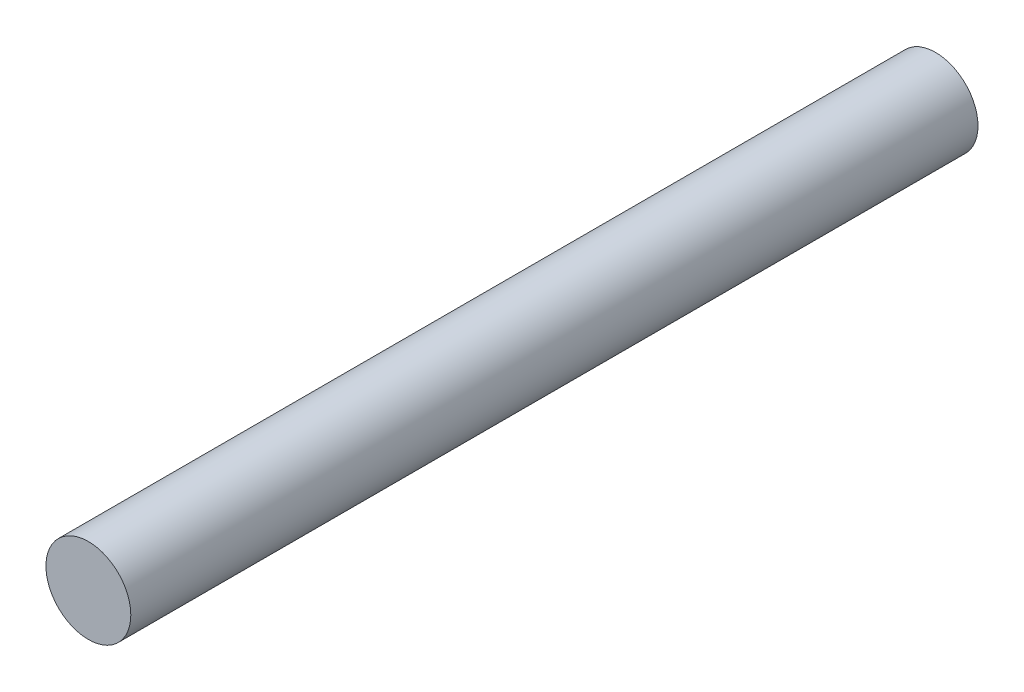
ISO-10303-21;
HEADER;
FILE_DESCRIPTION(('STEP AP214'),'2;1');
FILE_NAME('part.step','',(''),(''),'','','');
FILE_SCHEMA(('AUTOMOTIVE_DESIGN { 1 0 10303 214 1 1 1 1 }'));
ENDSEC;
DATA;
#1=APPLICATION_CONTEXT('core data for automotive mechanical design processes');
#2=APPLICATION_PROTOCOL_DEFINITION('international standard','automotive_design',2000,#1);
#3=PRODUCT_CONTEXT('',#1,'mechanical');
#4=PRODUCT('Part','Part','',(#3));
#5=PRODUCT_RELATED_PRODUCT_CATEGORY('part','',(#4));
#6=PRODUCT_DEFINITION_FORMATION('','',#4);
#7=PRODUCT_DEFINITION_CONTEXT('part definition',#1,'design');
#8=PRODUCT_DEFINITION('design','',#6,#7);
#9=PRODUCT_DEFINITION_SHAPE('','',#8);
#10=(LENGTH_UNIT() NAMED_UNIT(*) SI_UNIT(.MILLI.,.METRE.));
#11=(NAMED_UNIT(*) PLANE_ANGLE_UNIT() SI_UNIT($,.RADIAN.));
#12=(NAMED_UNIT(*) SI_UNIT($,.STERADIAN.) SOLID_ANGLE_UNIT());
#13=UNCERTAINTY_MEASURE_WITH_UNIT(LENGTH_MEASURE(1.E-05),#10,'distance_accuracy_value','');
#14=(GEOMETRIC_REPRESENTATION_CONTEXT(3) GLOBAL_UNCERTAINTY_ASSIGNED_CONTEXT((#13)) GLOBAL_UNIT_ASSIGNED_CONTEXT((#10,
#11,#12)) REPRESENTATION_CONTEXT('',''));
#15=CARTESIAN_POINT('',(0.,0.,0.));
#16=DIRECTION('',(0.,0.,1.));
#17=DIRECTION('',(1.,0.,0.));
#18=AXIS2_PLACEMENT_3D('',#15,#16,#17);
#19=CARTESIAN_POINT('',(0.,0.,50.45));
#20=DIRECTION('',(0.,0.,-1.));
#21=DIRECTION('',(-1.,0.,0.));
#22=AXIS2_PLACEMENT_3D('',#19,#20,#21);
#23=CYLINDRICAL_SURFACE('',#22,2.475);
#24=CARTESIAN_POINT('',(0.,0.,1.05031130731457));
#25=DIRECTION('',(0.,0.,1.));
#26=DIRECTION('',(1.,0.,0.));
#27=AXIS2_PLACEMENT_3D('',#24,#25,#26);
#28=CIRCLE('',#27,2.475);
#29=CARTESIAN_POINT('',(2.475,0.,1.05031130731457));
#30=VERTEX_POINT('',#29);
#31=EDGE_CURVE('E48',#30,#30,#28,.T.);
#32=ORIENTED_EDGE('',*,*,#31,.T.);
#33=EDGE_LOOP('',(#32));
#34=FACE_BOUND('',#33,.T.);
#35=CARTESIAN_POINT('',(0.,0.,50.45));
#36=DIRECTION('',(0.,0.,1.));
#37=DIRECTION('',(1.,0.,0.));
#38=AXIS2_PLACEMENT_3D('',#35,#36,#37);
#39=CIRCLE('',#38,2.475);
#40=CARTESIAN_POINT('',(2.475,0.,50.45));
#41=VERTEX_POINT('',#40);
#42=EDGE_CURVE('E53',#41,#41,#39,.T.);
#43=ORIENTED_EDGE('',*,*,#42,.F.);
#44=EDGE_LOOP('',(#43));
#45=FACE_BOUND('',#44,.T.);
#46=ADVANCED_FACE('F39',(#34,#45),#23,.T.);
#47=CARTESIAN_POINT('',(0.,0.,50.45));
#48=DIRECTION('',(0.,0.,1.));
#49=DIRECTION('',(1.,0.,0.));
#50=AXIS2_PLACEMENT_3D('',#47,#48,#49);
#51=PLANE('',#50);
#52=ORIENTED_EDGE('',*,*,#42,.T.);
#53=EDGE_LOOP('',(#52));
#54=FACE_BOUND('',#53,.T.);
#55=ADVANCED_FACE('F61',(#54),#51,.T.);
#56=CARTESIAN_POINT('',(0.,0.,0.));
#57=DIRECTION('',(0.,0.,1.));
#58=DIRECTION('',(1.,0.,0.));
#59=AXIS2_PLACEMENT_3D('',#56,#57,#58);
#60=PLANE('',#59);
#61=CARTESIAN_POINT('',(0.,0.,0.));
#62=DIRECTION('',(0.,0.,1.));
#63=DIRECTION('',(1.,0.,0.));
#64=AXIS2_PLACEMENT_3D('',#61,#62,#63);
#65=CIRCLE('',#64,0.974999999999983);
#66=CARTESIAN_POINT('',(0.974999999999983,0.,0.));
#67=VERTEX_POINT('',#66);
#68=EDGE_CURVE('E10',#67,#67,#65,.F.);
#69=ORIENTED_EDGE('',*,*,#68,.T.);
#70=EDGE_LOOP('',(#69));
#71=FACE_BOUND('',#70,.T.);
#72=ADVANCED_FACE('F67',(#71),#60,.F.);
#73=CARTESIAN_POINT('',(0.,0.,1.05031130731457));
#74=DIRECTION('',(0.,0.,1.));
#75=DIRECTION('',(1.,0.,0.));
#76=AXIS2_PLACEMENT_3D('',#73,#74,#75);
#77=CONICAL_SURFACE('',#76,2.475,0.959931088596882);
#78=ORIENTED_EDGE('',*,*,#68,.F.);
#79=EDGE_LOOP('',(#78));
#80=FACE_BOUND('',#79,.T.);
#81=ORIENTED_EDGE('',*,*,#31,.F.);
#82=EDGE_LOOP('',(#81));
#83=FACE_BOUND('',#82,.T.);
#84=ADVANCED_FACE('F42',(#80,#83),#77,.T.);
#85=CLOSED_SHELL('',(#46,#55,#72,#84));
#86=MANIFOLD_SOLID_BREP('B2',#85);
#87=ADVANCED_BREP_SHAPE_REPRESENTATION('',(#18,#86),#14);
#88=SHAPE_DEFINITION_REPRESENTATION(#9,#87);
ENDSEC;
END-ISO-10303-21;
